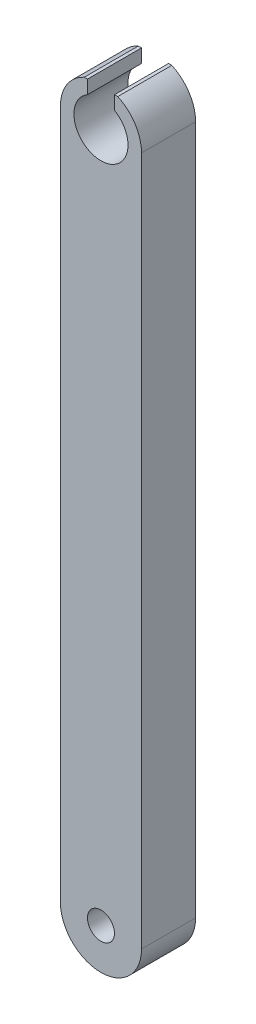
ISO-10303-21;
HEADER;
FILE_DESCRIPTION(('STEP AP214'),'2;1');
FILE_NAME('part.step','',(''),(''),'','','');
FILE_SCHEMA(('AUTOMOTIVE_DESIGN { 1 0 10303 214 1 1 1 1 }'));
ENDSEC;
DATA;
#1=APPLICATION_CONTEXT('core data for automotive mechanical design processes');
#2=APPLICATION_PROTOCOL_DEFINITION('international standard','automotive_design',2000,#1);
#3=PRODUCT_CONTEXT('',#1,'mechanical');
#4=PRODUCT('Part','Part','',(#3));
#5=PRODUCT_RELATED_PRODUCT_CATEGORY('part','',(#4));
#6=PRODUCT_DEFINITION_FORMATION('','',#4);
#7=PRODUCT_DEFINITION_CONTEXT('part definition',#1,'design');
#8=PRODUCT_DEFINITION('design','',#6,#7);
#9=PRODUCT_DEFINITION_SHAPE('','',#8);
#10=(LENGTH_UNIT() NAMED_UNIT(*) SI_UNIT(.MILLI.,.METRE.));
#11=(NAMED_UNIT(*) PLANE_ANGLE_UNIT() SI_UNIT($,.RADIAN.));
#12=(NAMED_UNIT(*) SI_UNIT($,.STERADIAN.) SOLID_ANGLE_UNIT());
#13=UNCERTAINTY_MEASURE_WITH_UNIT(LENGTH_MEASURE(1.E-05),#10,'distance_accuracy_value','');
#14=(GEOMETRIC_REPRESENTATION_CONTEXT(3) GLOBAL_UNCERTAINTY_ASSIGNED_CONTEXT((#13)) GLOBAL_UNIT_ASSIGNED_CONTEXT((#10,
#11,#12)) REPRESENTATION_CONTEXT('',''));
#15=CARTESIAN_POINT('',(0.,0.,0.));
#16=DIRECTION('',(0.,0.,1.));
#17=DIRECTION('',(1.,0.,0.));
#18=AXIS2_PLACEMENT_3D('',#15,#16,#17);
#19=CARTESIAN_POINT('',(0.,25.5,2.));
#20=DIRECTION('',(0.,0.,-1.));
#21=DIRECTION('',(-1.,0.,0.));
#22=AXIS2_PLACEMENT_3D('',#19,#20,#21);
#23=CYLINDRICAL_SURFACE('',#22,1.5);
#24=DIRECTION('',(0.,0.,1.));
#25=VECTOR('',#24,1.);
#26=CARTESIAN_POINT('',(-0.619656837463739,26.8660254037844,-8.));
#27=LINE('',#26,#25);
#28=CARTESIAN_POINT('',(-0.619656837463739,26.8660254037844,0.));
#29=VERTEX_POINT('',#28);
#30=CARTESIAN_POINT('',(-0.619656837463739,26.8660254037844,2.));
#31=VERTEX_POINT('',#30);
#32=EDGE_CURVE('E147',#29,#31,#27,.T.);
#33=ORIENTED_EDGE('',*,*,#32,.F.);
#34=CARTESIAN_POINT('',(0.,25.5,0.));
#35=DIRECTION('',(0.,0.,1.));
#36=DIRECTION('',(1.,0.,0.));
#37=AXIS2_PLACEMENT_3D('',#34,#35,#36);
#38=CIRCLE('',#37,1.5);
#39=CARTESIAN_POINT('',(-1.5,25.5,0.));
#40=VERTEX_POINT('',#39);
#41=EDGE_CURVE('E86',#29,#40,#38,.T.);
#42=ORIENTED_EDGE('',*,*,#41,.T.);
#43=DIRECTION('',(0.,0.,-1.));
#44=VECTOR('',#43,1.);
#45=CARTESIAN_POINT('',(-1.5,25.5,2.));
#46=LINE('',#45,#44);
#47=CARTESIAN_POINT('',(-1.5,25.5,2.));
#48=VERTEX_POINT('',#47);
#49=EDGE_CURVE('E158',#48,#40,#46,.T.);
#50=ORIENTED_EDGE('',*,*,#49,.F.);
#51=CARTESIAN_POINT('',(0.,25.5,2.));
#52=DIRECTION('',(0.,0.,1.));
#53=DIRECTION('',(1.,0.,0.));
#54=AXIS2_PLACEMENT_3D('',#51,#52,#53);
#55=CIRCLE('',#54,1.5);
#56=EDGE_CURVE('E64',#31,#48,#55,.T.);
#57=ORIENTED_EDGE('',*,*,#56,.F.);
#58=EDGE_LOOP('',(#33,#42,#50,#57));
#59=FACE_BOUND('',#58,.T.);
#60=ADVANCED_FACE('F40',(#59),#23,.T.);
#61=CARTESIAN_POINT('',(-1.5,0.,2.));
#62=DIRECTION('',(-1.,0.,0.));
#63=DIRECTION('',(0.,-1.,0.));
#64=AXIS2_PLACEMENT_3D('',#61,#62,#63);
#65=PLANE('',#64);
#66=DIRECTION('',(0.,1.,0.));
#67=VECTOR('',#66,1.);
#68=CARTESIAN_POINT('',(-1.5,0.,0.));
#69=LINE('',#68,#67);
#70=CARTESIAN_POINT('',(-1.5,0.,0.));
#71=VERTEX_POINT('',#70);
#72=EDGE_CURVE('E163',#71,#40,#69,.T.);
#73=ORIENTED_EDGE('',*,*,#72,.F.);
#74=DIRECTION('',(0.,0.,-1.));
#75=VECTOR('',#74,1.);
#76=CARTESIAN_POINT('',(-1.5,0.,2.));
#77=LINE('',#76,#75);
#78=CARTESIAN_POINT('',(-1.5,0.,2.));
#79=VERTEX_POINT('',#78);
#80=EDGE_CURVE('E93',#79,#71,#77,.T.);
#81=ORIENTED_EDGE('',*,*,#80,.F.);
#82=DIRECTION('',(0.,1.,0.));
#83=VECTOR('',#82,1.);
#84=CARTESIAN_POINT('',(-1.5,0.,2.));
#85=LINE('',#84,#83);
#86=EDGE_CURVE('E174',#79,#48,#85,.T.);
#87=ORIENTED_EDGE('',*,*,#86,.T.);
#88=ORIENTED_EDGE('',*,*,#49,.T.);
#89=EDGE_LOOP('',(#73,#81,#87,#88));
#90=FACE_BOUND('',#89,.T.);
#91=ADVANCED_FACE('F42',(#90),#65,.T.);
#92=CARTESIAN_POINT('',(0.,0.,2.));
#93=DIRECTION('',(0.,0.,-1.));
#94=DIRECTION('',(-1.,0.,0.));
#95=AXIS2_PLACEMENT_3D('',#92,#93,#94);
#96=CYLINDRICAL_SURFACE('',#95,1.5);
#97=CARTESIAN_POINT('',(0.,0.,0.));
#98=DIRECTION('',(0.,0.,1.));
#99=DIRECTION('',(1.,0.,0.));
#100=AXIS2_PLACEMENT_3D('',#97,#98,#99);
#101=CIRCLE('',#100,1.5);
#102=CARTESIAN_POINT('',(1.5,0.,0.));
#103=VERTEX_POINT('',#102);
#104=EDGE_CURVE('E166',#71,#103,#101,.T.);
#105=ORIENTED_EDGE('',*,*,#104,.T.);
#106=DIRECTION('',(0.,0.,-1.));
#107=VECTOR('',#106,1.);
#108=CARTESIAN_POINT('',(1.5,0.,2.));
#109=LINE('',#108,#107);
#110=CARTESIAN_POINT('',(1.5,0.,2.));
#111=VERTEX_POINT('',#110);
#112=EDGE_CURVE('E178',#111,#103,#109,.T.);
#113=ORIENTED_EDGE('',*,*,#112,.F.);
#114=CARTESIAN_POINT('',(0.,0.,2.));
#115=DIRECTION('',(0.,0.,1.));
#116=DIRECTION('',(1.,0.,0.));
#117=AXIS2_PLACEMENT_3D('',#114,#115,#116);
#118=CIRCLE('',#117,1.5);
#119=EDGE_CURVE('E211',#79,#111,#118,.T.);
#120=ORIENTED_EDGE('',*,*,#119,.F.);
#121=ORIENTED_EDGE('',*,*,#80,.T.);
#122=EDGE_LOOP('',(#105,#113,#120,#121));
#123=FACE_BOUND('',#122,.T.);
#124=ADVANCED_FACE('F214',(#123),#96,.T.);
#125=CARTESIAN_POINT('',(1.5,0.,2.));
#126=DIRECTION('',(-1.,0.,0.));
#127=DIRECTION('',(0.,-1.,0.));
#128=AXIS2_PLACEMENT_3D('',#125,#126,#127);
#129=PLANE('',#128);
#130=DIRECTION('',(0.,1.,0.));
#131=VECTOR('',#130,1.);
#132=CARTESIAN_POINT('',(1.5,0.,0.));
#133=LINE('',#132,#131);
#134=CARTESIAN_POINT('',(1.49999999999991,25.5,0.));
#135=VERTEX_POINT('',#134);
#136=EDGE_CURVE('E168',#103,#135,#133,.T.);
#137=ORIENTED_EDGE('',*,*,#136,.T.);
#138=DIRECTION('',(0.,0.,-1.));
#139=VECTOR('',#138,1.);
#140=CARTESIAN_POINT('',(1.49999999999991,25.5,2.));
#141=LINE('',#140,#139);
#142=CARTESIAN_POINT('',(1.49999999999991,25.5,2.));
#143=VERTEX_POINT('',#142);
#144=EDGE_CURVE('E176',#143,#135,#141,.T.);
#145=ORIENTED_EDGE('',*,*,#144,.F.);
#146=DIRECTION('',(0.,1.,0.));
#147=VECTOR('',#146,1.);
#148=CARTESIAN_POINT('',(1.5,0.,2.));
#149=LINE('',#148,#147);
#150=EDGE_CURVE('E153',#111,#143,#149,.T.);
#151=ORIENTED_EDGE('',*,*,#150,.F.);
#152=ORIENTED_EDGE('',*,*,#112,.T.);
#153=EDGE_LOOP('',(#137,#145,#151,#152));
#154=FACE_BOUND('',#153,.T.);
#155=ADVANCED_FACE('F218',(#154),#129,.F.);
#156=CARTESIAN_POINT('',(0.619656837463739,26.8660254037844,0.));
#157=VERTEX_POINT('',#156);
#158=EDGE_CURVE('E146',#135,#157,#38,.T.);
#159=ORIENTED_EDGE('',*,*,#158,.T.);
#160=DIRECTION('',(0.,0.,1.));
#161=VECTOR('',#160,1.);
#162=CARTESIAN_POINT('',(0.619656837463739,26.8660254037844,-8.));
#163=LINE('',#162,#161);
#164=CARTESIAN_POINT('',(0.619656837463739,26.8660254037844,2.));
#165=VERTEX_POINT('',#164);
#166=EDGE_CURVE('E131',#157,#165,#163,.T.);
#167=ORIENTED_EDGE('',*,*,#166,.T.);
#168=EDGE_CURVE('E144',#143,#165,#55,.T.);
#169=ORIENTED_EDGE('',*,*,#168,.F.);
#170=ORIENTED_EDGE('',*,*,#144,.T.);
#171=EDGE_LOOP('',(#159,#167,#169,#170));
#172=FACE_BOUND('',#171,.T.);
#173=ADVANCED_FACE('F142',(#172),#23,.T.);
#174=CARTESIAN_POINT('',(0.,0.,2.));
#175=DIRECTION('',(0.,0.,-1.));
#176=DIRECTION('',(-1.,0.,0.));
#177=AXIS2_PLACEMENT_3D('',#174,#175,#176);
#178=CYLINDRICAL_SURFACE('',#177,0.5);
#179=CARTESIAN_POINT('',(0.,0.,2.));
#180=DIRECTION('',(0.,0.,1.));
#181=DIRECTION('',(1.,0.,0.));
#182=AXIS2_PLACEMENT_3D('',#179,#180,#181);
#183=CIRCLE('',#182,0.5);
#184=CARTESIAN_POINT('',(0.5,0.,2.));
#185=VERTEX_POINT('',#184);
#186=EDGE_CURVE('E155',#185,#185,#183,.T.);
#187=ORIENTED_EDGE('',*,*,#186,.T.);
#188=EDGE_LOOP('',(#187));
#189=FACE_BOUND('',#188,.T.);
#190=CARTESIAN_POINT('',(0.,0.,0.));
#191=DIRECTION('',(0.,0.,1.));
#192=DIRECTION('',(1.,0.,0.));
#193=AXIS2_PLACEMENT_3D('',#190,#191,#192);
#194=CIRCLE('',#193,0.5);
#195=CARTESIAN_POINT('',(0.5,0.,0.));
#196=VERTEX_POINT('',#195);
#197=EDGE_CURVE('E171',#196,#196,#194,.T.);
#198=ORIENTED_EDGE('',*,*,#197,.F.);
#199=EDGE_LOOP('',(#198));
#200=FACE_BOUND('',#199,.T.);
#201=ADVANCED_FACE('F238',(#189,#200),#178,.F.);
#202=CARTESIAN_POINT('',(0.,0.,2.));
#203=DIRECTION('',(0.,0.,1.));
#204=DIRECTION('',(1.,0.,0.));
#205=AXIS2_PLACEMENT_3D('',#202,#203,#204);
#206=PLANE('',#205);
#207=DIRECTION('',(1.,0.,0.));
#208=VECTOR('',#207,1.);
#209=CARTESIAN_POINT('',(0.,26.8660254037844,2.));
#210=LINE('',#209,#208);
#211=CARTESIAN_POINT('',(0.5,26.8660254037844,2.));
#212=VERTEX_POINT('',#211);
#213=EDGE_CURVE('E128',#212,#165,#210,.T.);
#214=ORIENTED_EDGE('',*,*,#213,.F.);
#215=DIRECTION('',(0.,1.,0.));
#216=VECTOR('',#215,1.);
#217=CARTESIAN_POINT('',(0.5,0.,2.));
#218=LINE('',#217,#216);
#219=CARTESIAN_POINT('',(0.5,26.3660254037844,2.));
#220=VERTEX_POINT('',#219);
#221=EDGE_CURVE('E148',#220,#212,#218,.T.);
#222=ORIENTED_EDGE('',*,*,#221,.F.);
#223=CARTESIAN_POINT('',(0.,25.5,2.));
#224=DIRECTION('',(0.,0.,1.));
#225=DIRECTION('',(1.,0.,0.));
#226=AXIS2_PLACEMENT_3D('',#223,#224,#225);
#227=CIRCLE('',#226,1.);
#228=CARTESIAN_POINT('',(-0.5,26.3660254037844,2.));
#229=VERTEX_POINT('',#228);
#230=EDGE_CURVE('E202',#229,#220,#227,.T.);
#231=ORIENTED_EDGE('',*,*,#230,.F.);
#232=DIRECTION('',(0.,1.,0.));
#233=VECTOR('',#232,1.);
#234=CARTESIAN_POINT('',(-0.5,0.,2.));
#235=LINE('',#234,#233);
#236=CARTESIAN_POINT('',(-0.5,26.8660254037844,2.));
#237=VERTEX_POINT('',#236);
#238=EDGE_CURVE('E387',#229,#237,#235,.T.);
#239=ORIENTED_EDGE('',*,*,#238,.T.);
#240=DIRECTION('',(-1.,0.,0.));
#241=VECTOR('',#240,1.);
#242=CARTESIAN_POINT('',(0.,26.8660254037844,2.));
#243=LINE('',#242,#241);
#244=EDGE_CURVE('E137',#237,#31,#243,.T.);
#245=ORIENTED_EDGE('',*,*,#244,.T.);
#246=ORIENTED_EDGE('',*,*,#56,.T.);
#247=ORIENTED_EDGE('',*,*,#86,.F.);
#248=ORIENTED_EDGE('',*,*,#119,.T.);
#249=ORIENTED_EDGE('',*,*,#150,.T.);
#250=ORIENTED_EDGE('',*,*,#168,.T.);
#251=EDGE_LOOP('',(#214,#222,#231,#239,#245,#246,#247,#248,#249,#250));
#252=FACE_BOUND('',#251,.T.);
#253=ORIENTED_EDGE('',*,*,#186,.F.);
#254=EDGE_LOOP('',(#253));
#255=FACE_BOUND('',#254,.T.);
#256=ADVANCED_FACE('F150',(#252,#255),#206,.T.);
#257=CARTESIAN_POINT('',(0.,0.,0.));
#258=DIRECTION('',(0.,0.,1.));
#259=DIRECTION('',(1.,0.,0.));
#260=AXIS2_PLACEMENT_3D('',#257,#258,#259);
#261=PLANE('',#260);
#262=DIRECTION('',(0.,1.,0.));
#263=VECTOR('',#262,1.);
#264=CARTESIAN_POINT('',(0.5,0.,0.));
#265=LINE('',#264,#263);
#266=CARTESIAN_POINT('',(0.5,26.3660254037844,0.));
#267=VERTEX_POINT('',#266);
#268=CARTESIAN_POINT('',(0.5,26.8660254037844,0.));
#269=VERTEX_POINT('',#268);
#270=EDGE_CURVE('E48',#267,#269,#265,.T.);
#271=ORIENTED_EDGE('',*,*,#270,.T.);
#272=DIRECTION('',(1.,0.,0.));
#273=VECTOR('',#272,1.);
#274=CARTESIAN_POINT('',(0.,26.8660254037844,0.));
#275=LINE('',#274,#273);
#276=EDGE_CURVE('E11',#269,#157,#275,.T.);
#277=ORIENTED_EDGE('',*,*,#276,.T.);
#278=ORIENTED_EDGE('',*,*,#158,.F.);
#279=ORIENTED_EDGE('',*,*,#136,.F.);
#280=ORIENTED_EDGE('',*,*,#104,.F.);
#281=ORIENTED_EDGE('',*,*,#72,.T.);
#282=ORIENTED_EDGE('',*,*,#41,.F.);
#283=DIRECTION('',(-1.,0.,0.));
#284=VECTOR('',#283,1.);
#285=CARTESIAN_POINT('',(0.,26.8660254037844,0.));
#286=LINE('',#285,#284);
#287=CARTESIAN_POINT('',(-0.5,26.8660254037844,0.));
#288=VERTEX_POINT('',#287);
#289=EDGE_CURVE('E182',#288,#29,#286,.T.);
#290=ORIENTED_EDGE('',*,*,#289,.F.);
#291=DIRECTION('',(0.,1.,0.));
#292=VECTOR('',#291,1.);
#293=CARTESIAN_POINT('',(-0.5,0.,0.));
#294=LINE('',#293,#292);
#295=CARTESIAN_POINT('',(-0.5,26.3660254037844,0.));
#296=VERTEX_POINT('',#295);
#297=EDGE_CURVE('E184',#296,#288,#294,.T.);
#298=ORIENTED_EDGE('',*,*,#297,.F.);
#299=CARTESIAN_POINT('',(0.,25.5,0.));
#300=DIRECTION('',(0.,0.,1.));
#301=DIRECTION('',(1.,0.,0.));
#302=AXIS2_PLACEMENT_3D('',#299,#300,#301);
#303=CIRCLE('',#302,1.);
#304=EDGE_CURVE('E186',#296,#267,#303,.T.);
#305=ORIENTED_EDGE('',*,*,#304,.T.);
#306=EDGE_LOOP('',(#271,#277,#278,#279,#280,#281,#282,#290,#298,#305));
#307=FACE_BOUND('',#306,.T.);
#308=ORIENTED_EDGE('',*,*,#197,.T.);
#309=EDGE_LOOP('',(#308));
#310=FACE_BOUND('',#309,.T.);
#311=ADVANCED_FACE('F190',(#307,#310),#261,.F.);
#312=CARTESIAN_POINT('',(0.,26.8660254037844,-8.));
#313=DIRECTION('',(0.,-1.,0.));
#314=DIRECTION('',(0.,0.,-1.));
#315=AXIS2_PLACEMENT_3D('',#312,#313,#314);
#316=PLANE('',#315);
#317=DIRECTION('',(0.,0.,1.));
#318=VECTOR('',#317,1.);
#319=CARTESIAN_POINT('',(0.5,26.8660254037844,-8.));
#320=LINE('',#319,#318);
#321=EDGE_CURVE('E133',#269,#212,#320,.T.);
#322=ORIENTED_EDGE('',*,*,#321,.T.);
#323=ORIENTED_EDGE('',*,*,#213,.T.);
#324=ORIENTED_EDGE('',*,*,#166,.F.);
#325=ORIENTED_EDGE('',*,*,#276,.F.);
#326=EDGE_LOOP('',(#322,#323,#324,#325));
#327=FACE_BOUND('',#326,.T.);
#328=ADVANCED_FACE('F130',(#327),#316,.F.);
#329=CARTESIAN_POINT('',(0.5,0.,-8.));
#330=DIRECTION('',(1.,0.,0.));
#331=DIRECTION('',(0.,0.,-1.));
#332=AXIS2_PLACEMENT_3D('',#329,#330,#331);
#333=PLANE('',#332);
#334=DIRECTION('',(0.,0.,1.));
#335=VECTOR('',#334,1.);
#336=CARTESIAN_POINT('',(0.5,26.3660254037844,-8.));
#337=LINE('',#336,#335);
#338=EDGE_CURVE('E196',#267,#220,#337,.T.);
#339=ORIENTED_EDGE('',*,*,#338,.T.);
#340=ORIENTED_EDGE('',*,*,#221,.T.);
#341=ORIENTED_EDGE('',*,*,#321,.F.);
#342=ORIENTED_EDGE('',*,*,#270,.F.);
#343=EDGE_LOOP('',(#339,#340,#341,#342));
#344=FACE_BOUND('',#343,.T.);
#345=ADVANCED_FACE('F195',(#344),#333,.F.);
#346=CARTESIAN_POINT('',(0.,25.5,-8.));
#347=DIRECTION('',(0.,0.,1.));
#348=DIRECTION('',(1.,0.,0.));
#349=AXIS2_PLACEMENT_3D('',#346,#347,#348);
#350=CYLINDRICAL_SURFACE('',#349,1.);
#351=DIRECTION('',(0.,0.,1.));
#352=VECTOR('',#351,1.);
#353=CARTESIAN_POINT('',(-0.5,26.3660254037844,-8.));
#354=LINE('',#353,#352);
#355=EDGE_CURVE('E203',#296,#229,#354,.T.);
#356=ORIENTED_EDGE('',*,*,#355,.T.);
#357=ORIENTED_EDGE('',*,*,#230,.T.);
#358=ORIENTED_EDGE('',*,*,#338,.F.);
#359=ORIENTED_EDGE('',*,*,#304,.F.);
#360=EDGE_LOOP('',(#356,#357,#358,#359));
#361=FACE_BOUND('',#360,.T.);
#362=ADVANCED_FACE('F199',(#361),#350,.F.);
#363=CARTESIAN_POINT('',(-0.5,0.,-8.));
#364=DIRECTION('',(1.,0.,0.));
#365=DIRECTION('',(0.,0.,-1.));
#366=AXIS2_PLACEMENT_3D('',#363,#364,#365);
#367=PLANE('',#366);
#368=ORIENTED_EDGE('',*,*,#297,.T.);
#369=DIRECTION('',(0.,0.,1.));
#370=VECTOR('',#369,1.);
#371=CARTESIAN_POINT('',(-0.5,26.8660254037844,-8.));
#372=LINE('',#371,#370);
#373=EDGE_CURVE('E55',#288,#237,#372,.T.);
#374=ORIENTED_EDGE('',*,*,#373,.T.);
#375=ORIENTED_EDGE('',*,*,#238,.F.);
#376=ORIENTED_EDGE('',*,*,#355,.F.);
#377=EDGE_LOOP('',(#368,#374,#375,#376));
#378=FACE_BOUND('',#377,.T.);
#379=ADVANCED_FACE('F222',(#378),#367,.T.);
#380=CARTESIAN_POINT('',(0.,26.8660254037844,-8.));
#381=DIRECTION('',(0.,1.,0.));
#382=DIRECTION('',(0.,0.,1.));
#383=AXIS2_PLACEMENT_3D('',#380,#381,#382);
#384=PLANE('',#383);
#385=ORIENTED_EDGE('',*,*,#289,.T.);
#386=ORIENTED_EDGE('',*,*,#32,.T.);
#387=ORIENTED_EDGE('',*,*,#244,.F.);
#388=ORIENTED_EDGE('',*,*,#373,.F.);
#389=EDGE_LOOP('',(#385,#386,#387,#388));
#390=FACE_BOUND('',#389,.T.);
#391=ADVANCED_FACE('F220',(#390),#384,.T.);
#392=CLOSED_SHELL('',(#60,#91,#124,#155,#173,#201,#256,#311,#328,#345,#362,#379,#391));
#393=MANIFOLD_SOLID_BREP('B2',#392);
#394=ADVANCED_BREP_SHAPE_REPRESENTATION('',(#18,#393),#14);
#395=SHAPE_DEFINITION_REPRESENTATION(#9,#394);
ENDSEC;
END-ISO-10303-21;
